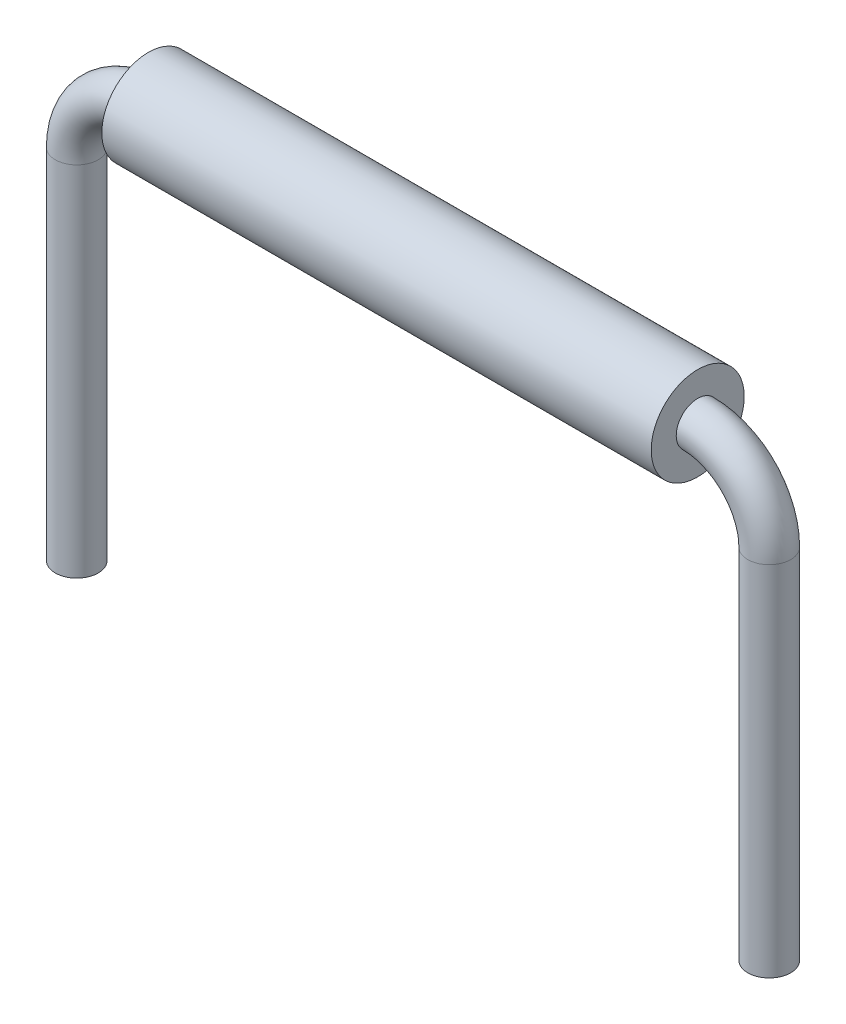
ISO-10303-21;
HEADER;
FILE_DESCRIPTION(('STEP AP214'),'2;1');
FILE_NAME('part.step','',(''),(''),'','','');
FILE_SCHEMA(('AUTOMOTIVE_DESIGN { 1 0 10303 214 1 1 1 1 }'));
ENDSEC;
DATA;
#1=APPLICATION_CONTEXT('core data for automotive mechanical design processes');
#2=APPLICATION_PROTOCOL_DEFINITION('international standard','automotive_design',2000,#1);
#3=PRODUCT_CONTEXT('',#1,'mechanical');
#4=PRODUCT('Part','Part','',(#3));
#5=PRODUCT_RELATED_PRODUCT_CATEGORY('part','',(#4));
#6=PRODUCT_DEFINITION_FORMATION('','',#4);
#7=PRODUCT_DEFINITION_CONTEXT('part definition',#1,'design');
#8=PRODUCT_DEFINITION('design','',#6,#7);
#9=PRODUCT_DEFINITION_SHAPE('','',#8);
#10=(LENGTH_UNIT() NAMED_UNIT(*) SI_UNIT(.MILLI.,.METRE.));
#11=(NAMED_UNIT(*) PLANE_ANGLE_UNIT() SI_UNIT($,.RADIAN.));
#12=(NAMED_UNIT(*) SI_UNIT($,.STERADIAN.) SOLID_ANGLE_UNIT());
#13=UNCERTAINTY_MEASURE_WITH_UNIT(LENGTH_MEASURE(1.E-05),#10,'distance_accuracy_value','');
#14=(GEOMETRIC_REPRESENTATION_CONTEXT(3) GLOBAL_UNCERTAINTY_ASSIGNED_CONTEXT((#13)) GLOBAL_UNIT_ASSIGNED_CONTEXT((#10,
#11,#12)) REPRESENTATION_CONTEXT('',''));
#15=CARTESIAN_POINT('',(0.,0.,0.));
#16=DIRECTION('',(0.,0.,1.));
#17=DIRECTION('',(1.,0.,0.));
#18=AXIS2_PLACEMENT_3D('',#15,#16,#17);
#19=CARTESIAN_POINT('',(3.8375,0.,0.));
#20=DIRECTION('',(1.,0.,0.));
#21=DIRECTION('',(0.,0.,-1.));
#22=AXIS2_PLACEMENT_3D('',#19,#20,#21);
#23=PLANE('',#22);
#24=CARTESIAN_POINT('',(3.8375,0.,0.));
#25=DIRECTION('',(1.,0.,0.));
#26=DIRECTION('',(0.,0.,-1.));
#27=AXIS2_PLACEMENT_3D('',#24,#25,#26);
#28=CIRCLE('',#27,0.65);
#29=CARTESIAN_POINT('',(3.8375,0.,-0.65));
#30=VERTEX_POINT('',#29);
#31=EDGE_CURVE('E11',#30,#30,#28,.T.);
#32=ORIENTED_EDGE('',*,*,#31,.T.);
#33=EDGE_LOOP('',(#32));
#34=FACE_BOUND('',#33,.T.);
#35=CARTESIAN_POINT('',(3.8375,0.,0.));
#36=DIRECTION('',(1.,0.,0.));
#37=DIRECTION('',(0.,0.,-1.));
#38=AXIS2_PLACEMENT_3D('',#35,#36,#37);
#39=CIRCLE('',#38,0.3);
#40=CARTESIAN_POINT('',(3.8375,0.,-0.3));
#41=VERTEX_POINT('',#40);
#42=EDGE_CURVE('E51',#41,#41,#39,.T.);
#43=ORIENTED_EDGE('',*,*,#42,.F.);
#44=EDGE_LOOP('',(#43));
#45=FACE_BOUND('',#44,.T.);
#46=ADVANCED_FACE('F44',(#34,#45),#23,.T.);
#47=CARTESIAN_POINT('',(3.8375,0.,0.));
#48=DIRECTION('',(-1.,0.,0.));
#49=DIRECTION('',(0.,0.,1.));
#50=AXIS2_PLACEMENT_3D('',#47,#48,#49);
#51=CYLINDRICAL_SURFACE('',#50,0.65);
#52=ORIENTED_EDGE('',*,*,#31,.F.);
#53=EDGE_LOOP('',(#52));
#54=FACE_BOUND('',#53,.T.);
#55=CARTESIAN_POINT('',(-3.8375,0.,0.));
#56=DIRECTION('',(1.,0.,0.));
#57=DIRECTION('',(0.,0.,-1.));
#58=AXIS2_PLACEMENT_3D('',#55,#56,#57);
#59=CIRCLE('',#58,0.65);
#60=CARTESIAN_POINT('',(-3.8375,0.,-0.65));
#61=VERTEX_POINT('',#60);
#62=EDGE_CURVE('E55',#61,#61,#59,.T.);
#63=ORIENTED_EDGE('',*,*,#62,.T.);
#64=EDGE_LOOP('',(#63));
#65=FACE_BOUND('',#64,.T.);
#66=ADVANCED_FACE('F46',(#54,#65),#51,.T.);
#67=CARTESIAN_POINT('',(3.8375,0.,0.));
#68=DIRECTION('',(-1.,0.,0.));
#69=DIRECTION('',(0.,0.,1.));
#70=AXIS2_PLACEMENT_3D('',#67,#68,#69);
#71=CYLINDRICAL_SURFACE('',#70,0.3);
#72=ORIENTED_EDGE('',*,*,#42,.T.);
#73=EDGE_LOOP('',(#72));
#74=FACE_BOUND('',#73,.T.);
#75=CARTESIAN_POINT('',(-3.8375,0.,0.));
#76=DIRECTION('',(1.,0.,0.));
#77=DIRECTION('',(0.,0.,-1.));
#78=AXIS2_PLACEMENT_3D('',#75,#76,#77);
#79=CIRCLE('',#78,0.3);
#80=CARTESIAN_POINT('',(-3.8375,0.,-0.3));
#81=VERTEX_POINT('',#80);
#82=EDGE_CURVE('E59',#81,#81,#79,.T.);
#83=ORIENTED_EDGE('',*,*,#82,.F.);
#84=EDGE_LOOP('',(#83));
#85=FACE_BOUND('',#84,.T.);
#86=ADVANCED_FACE('F68',(#74,#85),#71,.F.);
#87=CARTESIAN_POINT('',(-3.8375,0.,0.));
#88=DIRECTION('',(1.,0.,0.));
#89=DIRECTION('',(0.,0.,-1.));
#90=AXIS2_PLACEMENT_3D('',#87,#88,#89);
#91=PLANE('',#90);
#92=ORIENTED_EDGE('',*,*,#82,.T.);
#93=EDGE_LOOP('',(#92));
#94=FACE_BOUND('',#93,.T.);
#95=ORIENTED_EDGE('',*,*,#62,.F.);
#96=EDGE_LOOP('',(#95));
#97=FACE_BOUND('',#96,.T.);
#98=ADVANCED_FACE('F65',(#94,#97),#91,.F.);
#99=CLOSED_SHELL('',(#46,#66,#86,#98));
#100=MANIFOLD_SOLID_BREP('B2',#99);
#101=CARTESIAN_POINT('',(4.8375,-6.,0.));
#102=DIRECTION('',(0.,-1.,0.));
#103=DIRECTION('',(0.,0.,-1.));
#104=AXIS2_PLACEMENT_3D('',#101,#102,#103);
#105=PLANE('',#104);
#106=CARTESIAN_POINT('',(4.8375,-6.,0.));
#107=DIRECTION('',(0.,-1.,0.));
#108=DIRECTION('',(0.,0.,-1.));
#109=AXIS2_PLACEMENT_3D('',#106,#107,#108);
#110=CIRCLE('',#109,0.3);
#111=CARTESIAN_POINT('',(4.8375,-6.,-0.3));
#112=VERTEX_POINT('',#111);
#113=EDGE_CURVE('E127',#112,#112,#110,.T.);
#114=ORIENTED_EDGE('',*,*,#113,.T.);
#115=EDGE_LOOP('',(#114));
#116=FACE_BOUND('',#115,.T.);
#117=ADVANCED_FACE('F105',(#116),#105,.T.);
#118=CARTESIAN_POINT('',(-4.8375,-6.,0.));
#119=DIRECTION('',(0.,1.,0.));
#120=DIRECTION('',(0.,0.,-1.));
#121=AXIS2_PLACEMENT_3D('',#118,#119,#120);
#122=PLANE('',#121);
#123=CARTESIAN_POINT('',(-4.8375,-6.,0.));
#124=DIRECTION('',(0.,1.,0.));
#125=DIRECTION('',(0.,0.,-1.));
#126=AXIS2_PLACEMENT_3D('',#123,#124,#125);
#127=CIRCLE('',#126,0.3);
#128=CARTESIAN_POINT('',(-4.8375,-6.,-0.3));
#129=VERTEX_POINT('',#128);
#130=EDGE_CURVE('E43',#129,#129,#127,.T.);
#131=ORIENTED_EDGE('',*,*,#130,.F.);
#132=EDGE_LOOP('',(#131));
#133=FACE_BOUND('',#132,.T.);
#134=ADVANCED_FACE('F135',(#133),#122,.F.);
#135=CARTESIAN_POINT('',(4.8375,-6.,0.));
#136=DIRECTION('',(0.,1.,0.));
#137=DIRECTION('',(-1.,0.,0.));
#138=AXIS2_PLACEMENT_3D('',#135,#136,#137);
#139=CYLINDRICAL_SURFACE('',#138,0.3);
#140=CARTESIAN_POINT('',(4.8375,-0.999999999999999,0.));
#141=DIRECTION('',(0.,-1.,0.));
#142=DIRECTION('',(0.,0.,-1.));
#143=AXIS2_PLACEMENT_3D('',#140,#141,#142);
#144=CIRCLE('',#143,0.3);
#145=CARTESIAN_POINT('',(5.1375,-0.999999999999999,0.));
#146=VERTEX_POINT('',#145);
#147=EDGE_CURVE('E124',#146,#146,#144,.T.);
#148=ORIENTED_EDGE('',*,*,#147,.T.);
#149=EDGE_LOOP('',(#148));
#150=FACE_BOUND('',#149,.T.);
#151=ORIENTED_EDGE('',*,*,#113,.F.);
#152=EDGE_LOOP('',(#151));
#153=FACE_BOUND('',#152,.T.);
#154=ADVANCED_FACE('F132',(#150,#153),#139,.T.);
#155=CARTESIAN_POINT('',(3.8375,-0.999999999999999,0.));
#156=DIRECTION('',(0.,0.,1.));
#157=DIRECTION('',(1.,0.,0.));
#158=AXIS2_PLACEMENT_3D('',#155,#156,#157);
#159=TOROIDAL_SURFACE('',#158,0.999999999999998,0.3);
#160=CARTESIAN_POINT('',(3.8375,0.,0.));
#161=DIRECTION('',(1.,0.,0.));
#162=DIRECTION('',(0.,0.,-1.));
#163=AXIS2_PLACEMENT_3D('',#160,#161,#162);
#164=CIRCLE('',#163,0.3);
#165=CARTESIAN_POINT('',(3.8375,0.299999999999999,0.));
#166=VERTEX_POINT('',#165);
#167=EDGE_CURVE('E119',#166,#166,#164,.T.);
#168=CARTESIAN_POINT('',(3.8375,-0.999999999999999,0.));
#169=DIRECTION('',(0.,0.,1.));
#170=DIRECTION('',(1.,0.,0.));
#171=AXIS2_PLACEMENT_3D('',#168,#169,#170);
#172=CIRCLE('',#171,1.3);
#173=EDGE_CURVE('',#146,#166,#172,.T.);
#174=ORIENTED_EDGE('',*,*,#147,.F.);
#175=ORIENTED_EDGE('',*,*,#167,.T.);
#176=ORIENTED_EDGE('',*,*,#173,.T.);
#177=ORIENTED_EDGE('',*,*,#173,.F.);
#178=EDGE_LOOP('',(#174,#176,#175,#177));
#179=FACE_BOUND('',#178,.T.);
#180=ADVANCED_FACE('F134',(#179),#159,.T.);
#181=CARTESIAN_POINT('',(3.8375,0.,0.));
#182=DIRECTION('',(-1.,0.,0.));
#183=DIRECTION('',(0.,-1.,0.));
#184=AXIS2_PLACEMENT_3D('',#181,#182,#183);
#185=CYLINDRICAL_SURFACE('',#184,0.3);
#186=CARTESIAN_POINT('',(-3.8375,0.,0.));
#187=DIRECTION('',(1.,0.,0.));
#188=DIRECTION('',(0.,0.,-1.));
#189=AXIS2_PLACEMENT_3D('',#186,#187,#188);
#190=CIRCLE('',#189,0.3);
#191=CARTESIAN_POINT('',(-3.8375,0.299999999999999,0.));
#192=VERTEX_POINT('',#191);
#193=EDGE_CURVE('E115',#192,#192,#190,.T.);
#194=ORIENTED_EDGE('',*,*,#193,.T.);
#195=EDGE_LOOP('',(#194));
#196=FACE_BOUND('',#195,.T.);
#197=ORIENTED_EDGE('',*,*,#167,.F.);
#198=EDGE_LOOP('',(#197));
#199=FACE_BOUND('',#198,.T.);
#200=ADVANCED_FACE('F142',(#196,#199),#185,.T.);
#201=CARTESIAN_POINT('',(-3.8375,-1.,0.));
#202=DIRECTION('',(0.,0.,1.));
#203=DIRECTION('',(1.,0.,0.));
#204=AXIS2_PLACEMENT_3D('',#201,#202,#203);
#205=TOROIDAL_SURFACE('',#204,0.999999999999999,0.3);
#206=CARTESIAN_POINT('',(-4.8375,-1.,0.));
#207=DIRECTION('',(0.,1.,0.));
#208=DIRECTION('',(0.,0.,-1.));
#209=AXIS2_PLACEMENT_3D('',#206,#207,#208);
#210=CIRCLE('',#209,0.3);
#211=CARTESIAN_POINT('',(-5.1375,-1.,0.));
#212=VERTEX_POINT('',#211);
#213=EDGE_CURVE('E111',#212,#212,#210,.T.);
#214=CARTESIAN_POINT('',(-3.8375,-1.,0.));
#215=DIRECTION('',(0.,0.,1.));
#216=DIRECTION('',(1.,0.,0.));
#217=AXIS2_PLACEMENT_3D('',#214,#215,#216);
#218=CIRCLE('',#217,1.3);
#219=EDGE_CURVE('',#192,#212,#218,.T.);
#220=ORIENTED_EDGE('',*,*,#193,.F.);
#221=ORIENTED_EDGE('',*,*,#213,.T.);
#222=ORIENTED_EDGE('',*,*,#219,.T.);
#223=ORIENTED_EDGE('',*,*,#219,.F.);
#224=EDGE_LOOP('',(#220,#222,#221,#223));
#225=FACE_BOUND('',#224,.T.);
#226=ADVANCED_FACE('F148',(#225),#205,.T.);
#227=CARTESIAN_POINT('',(-4.8375,-1.,0.));
#228=DIRECTION('',(0.,-1.,0.));
#229=DIRECTION('',(0.,0.,-1.));
#230=AXIS2_PLACEMENT_3D('',#227,#228,#229);
#231=CYLINDRICAL_SURFACE('',#230,0.3);
#232=ORIENTED_EDGE('',*,*,#130,.T.);
#233=EDGE_LOOP('',(#232));
#234=FACE_BOUND('',#233,.T.);
#235=ORIENTED_EDGE('',*,*,#213,.F.);
#236=EDGE_LOOP('',(#235));
#237=FACE_BOUND('',#236,.T.);
#238=ADVANCED_FACE('F146',(#234,#237),#231,.T.);
#239=CLOSED_SHELL('',(#117,#134,#154,#180,#200,#226,#238));
#240=MANIFOLD_SOLID_BREP('B6',#239);
#241=ADVANCED_BREP_SHAPE_REPRESENTATION('',(#18,#100,#240),#14);
#242=SHAPE_DEFINITION_REPRESENTATION(#9,#241);
ENDSEC;
END-ISO-10303-21;
